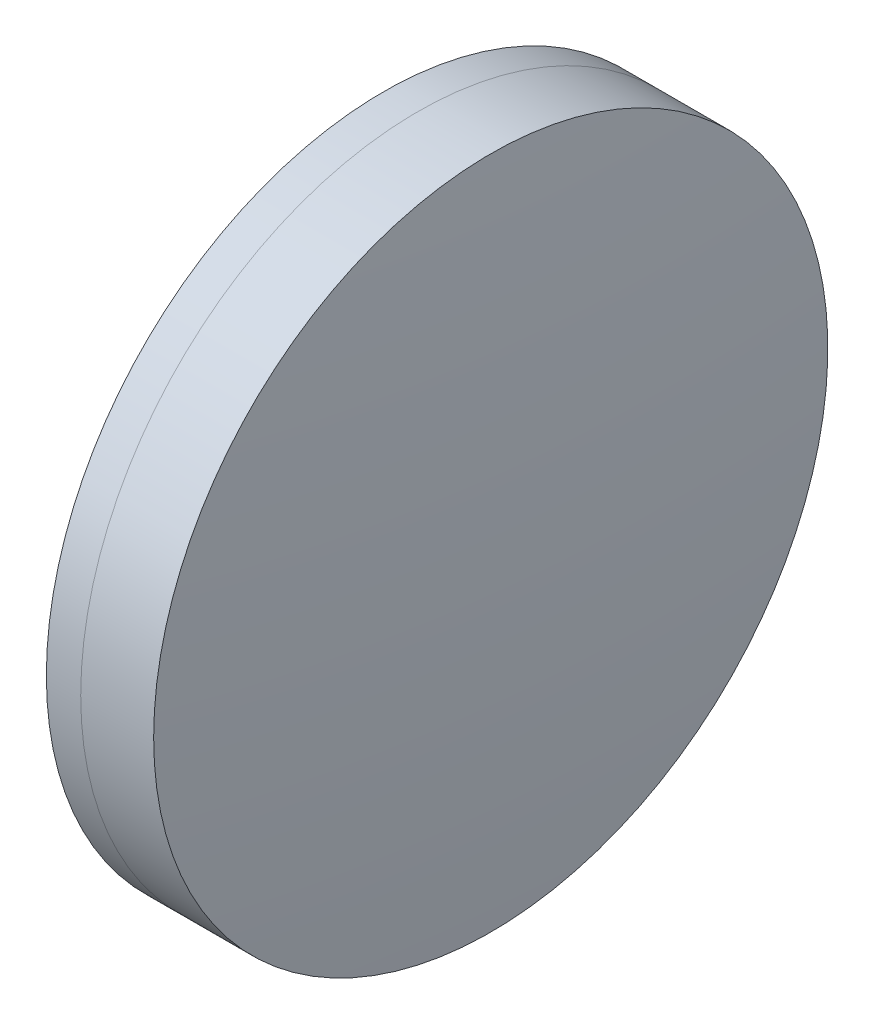
ISO-10303-21;
HEADER;
FILE_DESCRIPTION(('STEP AP214'),'2;1');
FILE_NAME('part.step','',(''),(''),'','','');
FILE_SCHEMA(('AUTOMOTIVE_DESIGN { 1 0 10303 214 1 1 1 1 }'));
ENDSEC;
DATA;
#1=APPLICATION_CONTEXT('core data for automotive mechanical design processes');
#2=APPLICATION_PROTOCOL_DEFINITION('international standard','automotive_design',2000,#1);
#3=PRODUCT_CONTEXT('',#1,'mechanical');
#4=PRODUCT('Part','Part','',(#3));
#5=PRODUCT_RELATED_PRODUCT_CATEGORY('part','',(#4));
#6=PRODUCT_DEFINITION_FORMATION('','',#4);
#7=PRODUCT_DEFINITION_CONTEXT('part definition',#1,'design');
#8=PRODUCT_DEFINITION('design','',#6,#7);
#9=PRODUCT_DEFINITION_SHAPE('','',#8);
#10=(LENGTH_UNIT() NAMED_UNIT(*) SI_UNIT(.MILLI.,.METRE.));
#11=(NAMED_UNIT(*) PLANE_ANGLE_UNIT() SI_UNIT($,.RADIAN.));
#12=(NAMED_UNIT(*) SI_UNIT($,.STERADIAN.) SOLID_ANGLE_UNIT());
#13=UNCERTAINTY_MEASURE_WITH_UNIT(LENGTH_MEASURE(1.E-05),#10,'distance_accuracy_value','');
#14=(GEOMETRIC_REPRESENTATION_CONTEXT(3) GLOBAL_UNCERTAINTY_ASSIGNED_CONTEXT((#13)) GLOBAL_UNIT_ASSIGNED_CONTEXT((#10,
#11,#12)) REPRESENTATION_CONTEXT('',''));
#15=CARTESIAN_POINT('',(0.,0.,0.));
#16=DIRECTION('',(0.,0.,1.));
#17=DIRECTION('',(1.,0.,0.));
#18=AXIS2_PLACEMENT_3D('',#15,#16,#17);
#19=CARTESIAN_POINT('',(210.135530353972,0.,0.));
#20=DIRECTION('',(-1.,0.,0.));
#21=DIRECTION('',(0.,0.,1.));
#22=AXIS2_PLACEMENT_3D('',#19,#20,#21);
#23=SPHERICAL_SURFACE('',#22,75.479);
#24=CARTESIAN_POINT('',(282.91656800115,0.,0.));
#25=DIRECTION('',(-1.,0.,0.));
#26=DIRECTION('',(0.,0.,1.));
#27=AXIS2_PLACEMENT_3D('',#24,#25,#26);
#28=CIRCLE('',#27,20.);
#29=CARTESIAN_POINT('',(282.91656800115,0.,20.));
#30=VERTEX_POINT('',#29);
#31=EDGE_CURVE('E11',#30,#30,#28,.T.);
#32=ORIENTED_EDGE('',*,*,#31,.T.);
#33=EDGE_LOOP('',(#32));
#34=FACE_BOUND('',#33,.T.);
#35=ADVANCED_FACE('F45',(#34),#23,.F.);
#36=CARTESIAN_POINT('',(-0.551919992657797,0.,0.));
#37=DIRECTION('',(-1.,0.,0.));
#38=DIRECTION('',(0.,0.,1.));
#39=AXIS2_PLACEMENT_3D('',#36,#37,#38);
#40=CYLINDRICAL_SURFACE('',#39,20.);
#41=CARTESIAN_POINT('',(287.244420163509,0.,0.));
#42=DIRECTION('',(-1.,0.,0.));
#43=DIRECTION('',(0.,0.,1.));
#44=AXIS2_PLACEMENT_3D('',#41,#42,#43);
#45=CIRCLE('',#44,20.);
#46=CARTESIAN_POINT('',(287.244420163509,0.,20.));
#47=VERTEX_POINT('',#46);
#48=EDGE_CURVE('E51',#47,#47,#45,.T.);
#49=ORIENTED_EDGE('',*,*,#48,.T.);
#50=EDGE_LOOP('',(#49));
#51=FACE_BOUND('',#50,.T.);
#52=ORIENTED_EDGE('',*,*,#31,.F.);
#53=EDGE_LOOP('',(#52));
#54=FACE_BOUND('',#53,.T.);
#55=ADVANCED_FACE('F57',(#51,#54),#40,.T.);
#56=CARTESIAN_POINT('',(57.8235303539719,0.,0.));
#57=DIRECTION('',(-1.,0.,0.));
#58=DIRECTION('',(0.,0.,1.));
#59=AXIS2_PLACEMENT_3D('',#56,#57,#58);
#60=SPHERICAL_SURFACE('',#59,230.291);
#61=ORIENTED_EDGE('',*,*,#48,.F.);
#62=EDGE_LOOP('',(#61));
#63=FACE_BOUND('',#62,.T.);
#64=ADVANCED_FACE('F60',(#63),#60,.T.);
#65=CLOSED_SHELL('',(#35,#55,#64));
#66=MANIFOLD_SOLID_BREP('B2',#65);
#67=CARTESIAN_POINT('',(379.683530353972,0.,0.));
#68=DIRECTION('',(-1.,0.,0.));
#69=DIRECTION('',(0.,0.,-1.));
#70=AXIS2_PLACEMENT_3D('',#67,#68,#69);
#71=SPHERICAL_SURFACE('',#70,100.809);
#72=CARTESIAN_POINT('',(280.878396474198,0.,0.));
#73=DIRECTION('',(-1.,0.,0.));
#74=DIRECTION('',(0.,0.,1.));
#75=AXIS2_PLACEMENT_3D('',#72,#73,#74);
#76=CIRCLE('',#75,20.);
#77=CARTESIAN_POINT('',(280.878396474198,0.,20.));
#78=VERTEX_POINT('',#77);
#79=EDGE_CURVE('E44',#78,#78,#76,.T.);
#80=ORIENTED_EDGE('',*,*,#79,.T.);
#81=EDGE_LOOP('',(#80));
#82=FACE_BOUND('',#81,.T.);
#83=ADVANCED_FACE('F86',(#82),#71,.T.);
#84=CARTESIAN_POINT('',(124.523309526045,0.,0.));
#85=DIRECTION('',(-1.,0.,0.));
#86=DIRECTION('',(0.,0.,1.));
#87=AXIS2_PLACEMENT_3D('',#84,#85,#86);
#88=CYLINDRICAL_SURFACE('',#87,20.);
#89=CARTESIAN_POINT('',(282.91656800115,0.,0.));
#90=DIRECTION('',(-1.,0.,0.));
#91=DIRECTION('',(0.,0.,1.));
#92=AXIS2_PLACEMENT_3D('',#89,#90,#91);
#93=CIRCLE('',#92,20.);
#94=CARTESIAN_POINT('',(282.91656800115,0.,20.));
#95=VERTEX_POINT('',#94);
#96=EDGE_CURVE('E92',#95,#95,#93,.T.);
#97=ORIENTED_EDGE('',*,*,#96,.T.);
#98=EDGE_LOOP('',(#97));
#99=FACE_BOUND('',#98,.T.);
#100=ORIENTED_EDGE('',*,*,#79,.F.);
#101=EDGE_LOOP('',(#100));
#102=FACE_BOUND('',#101,.T.);
#103=ADVANCED_FACE('F98',(#99,#102),#88,.T.);
#104=CARTESIAN_POINT('',(210.135530353972,0.,0.));
#105=DIRECTION('',(-1.,0.,0.));
#106=DIRECTION('',(0.,0.,1.));
#107=AXIS2_PLACEMENT_3D('',#104,#105,#106);
#108=SPHERICAL_SURFACE('',#107,75.479);
#109=ORIENTED_EDGE('',*,*,#96,.F.);
#110=EDGE_LOOP('',(#109));
#111=FACE_BOUND('',#110,.T.);
#112=ADVANCED_FACE('F101',(#111),#108,.T.);
#113=CLOSED_SHELL('',(#83,#103,#112));
#114=MANIFOLD_SOLID_BREP('B6',#113);
#115=ADVANCED_BREP_SHAPE_REPRESENTATION('',(#18,#66,#114),#14);
#116=SHAPE_DEFINITION_REPRESENTATION(#9,#115);
ENDSEC;
END-ISO-10303-21;
